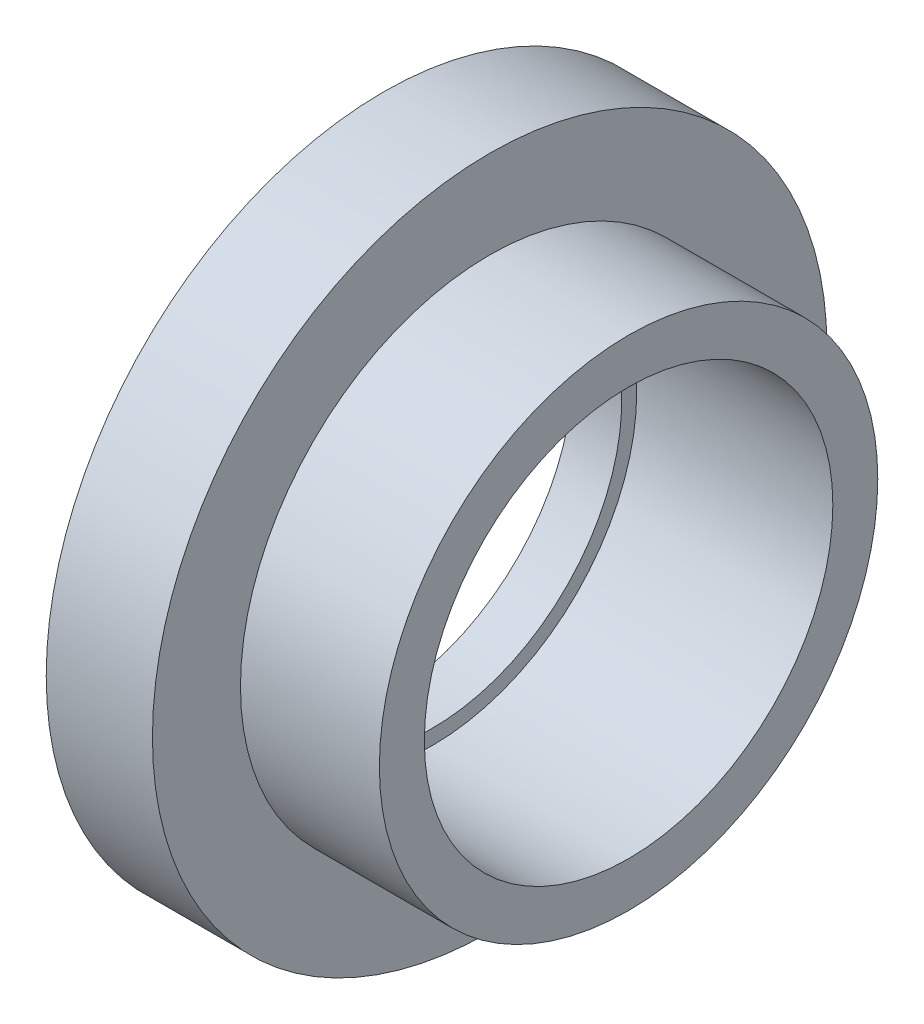
ISO-10303-21;
HEADER;
FILE_DESCRIPTION(('STEP AP214'),'2;1');
FILE_NAME('part.step','',(''),(''),'','','');
FILE_SCHEMA(('AUTOMOTIVE_DESIGN { 1 0 10303 214 1 1 1 1 }'));
ENDSEC;
DATA;
#1=APPLICATION_CONTEXT('core data for automotive mechanical design processes');
#2=APPLICATION_PROTOCOL_DEFINITION('international standard','automotive_design',2000,#1);
#3=PRODUCT_CONTEXT('',#1,'mechanical');
#4=PRODUCT('Part','Part','',(#3));
#5=PRODUCT_RELATED_PRODUCT_CATEGORY('part','',(#4));
#6=PRODUCT_DEFINITION_FORMATION('','',#4);
#7=PRODUCT_DEFINITION_CONTEXT('part definition',#1,'design');
#8=PRODUCT_DEFINITION('design','',#6,#7);
#9=PRODUCT_DEFINITION_SHAPE('','',#8);
#10=(LENGTH_UNIT() NAMED_UNIT(*) SI_UNIT(.MILLI.,.METRE.));
#11=(NAMED_UNIT(*) PLANE_ANGLE_UNIT() SI_UNIT($,.RADIAN.));
#12=(NAMED_UNIT(*) SI_UNIT($,.STERADIAN.) SOLID_ANGLE_UNIT());
#13=UNCERTAINTY_MEASURE_WITH_UNIT(LENGTH_MEASURE(1.E-05),#10,'distance_accuracy_value','');
#14=(GEOMETRIC_REPRESENTATION_CONTEXT(3) GLOBAL_UNCERTAINTY_ASSIGNED_CONTEXT((#13)) GLOBAL_UNIT_ASSIGNED_CONTEXT((#10,
#11,#12)) REPRESENTATION_CONTEXT('',''));
#15=CARTESIAN_POINT('',(0.,0.,0.));
#16=DIRECTION('',(0.,0.,1.));
#17=DIRECTION('',(1.,0.,0.));
#18=AXIS2_PLACEMENT_3D('',#15,#16,#17);
#19=CARTESIAN_POINT('',(7.,0.,0.));
#20=DIRECTION('',(-1.,0.,0.));
#21=DIRECTION('',(0.,0.,1.));
#22=AXIS2_PLACEMENT_3D('',#19,#20,#21);
#23=CYLINDRICAL_SURFACE('',#22,30.5);
#24=CARTESIAN_POINT('',(7.,0.,0.));
#25=DIRECTION('',(-1.,0.,0.));
#26=DIRECTION('',(0.,0.,1.));
#27=AXIS2_PLACEMENT_3D('',#24,#25,#26);
#28=CIRCLE('',#27,30.5);
#29=CARTESIAN_POINT('',(7.,0.,30.5));
#30=VERTEX_POINT('',#29);
#31=EDGE_CURVE('E38',#30,#30,#28,.T.);
#32=ORIENTED_EDGE('',*,*,#31,.F.);
#33=EDGE_LOOP('',(#32));
#34=FACE_BOUND('',#33,.T.);
#35=CARTESIAN_POINT('',(24.,0.,0.));
#36=DIRECTION('',(-1.,0.,0.));
#37=DIRECTION('',(0.,0.,1.));
#38=AXIS2_PLACEMENT_3D('',#35,#36,#37);
#39=CIRCLE('',#38,30.5);
#40=CARTESIAN_POINT('',(24.,0.,30.5));
#41=VERTEX_POINT('',#40);
#42=EDGE_CURVE('E16',#41,#41,#39,.F.);
#43=ORIENTED_EDGE('',*,*,#42,.F.);
#44=EDGE_LOOP('',(#43));
#45=FACE_BOUND('',#44,.T.);
#46=ADVANCED_FACE('F13',(#34,#45),#23,.T.);
#47=CARTESIAN_POINT('',(24.,30.5,30.8660010541286));
#48=DIRECTION('',(1.,0.,0.));
#49=DIRECTION('',(0.,-1.,0.));
#50=AXIS2_PLACEMENT_3D('',#47,#48,#49);
#51=PLANE('',#50);
#52=CARTESIAN_POINT('',(24.,0.,0.));
#53=DIRECTION('',(-1.,0.,0.));
#54=DIRECTION('',(0.,0.,1.));
#55=AXIS2_PLACEMENT_3D('',#52,#53,#54);
#56=CIRCLE('',#55,25.);
#57=CARTESIAN_POINT('',(24.,0.,25.));
#58=VERTEX_POINT('',#57);
#59=EDGE_CURVE('E36',#58,#58,#56,.F.);
#60=ORIENTED_EDGE('',*,*,#59,.F.);
#61=EDGE_LOOP('',(#60));
#62=FACE_BOUND('',#61,.T.);
#63=ORIENTED_EDGE('',*,*,#42,.T.);
#64=EDGE_LOOP('',(#63));
#65=FACE_BOUND('',#64,.T.);
#66=ADVANCED_FACE('F45',(#62,#65),#51,.T.);
#67=CARTESIAN_POINT('',(7.,41.275,41.7703021083259));
#68=DIRECTION('',(1.,0.,0.));
#69=DIRECTION('',(0.,-1.,0.));
#70=AXIS2_PLACEMENT_3D('',#67,#68,#69);
#71=PLANE('',#70);
#72=ORIENTED_EDGE('',*,*,#31,.T.);
#73=EDGE_LOOP('',(#72));
#74=FACE_BOUND('',#73,.T.);
#75=CARTESIAN_POINT('',(7.,0.,0.));
#76=DIRECTION('',(-1.,0.,0.));
#77=DIRECTION('',(0.,0.,1.));
#78=AXIS2_PLACEMENT_3D('',#75,#76,#77);
#79=CIRCLE('',#78,41.275);
#80=CARTESIAN_POINT('',(7.,0.,41.275));
#81=VERTEX_POINT('',#80);
#82=EDGE_CURVE('E33',#81,#81,#79,.T.);
#83=ORIENTED_EDGE('',*,*,#82,.F.);
#84=EDGE_LOOP('',(#83));
#85=FACE_BOUND('',#84,.T.);
#86=ADVANCED_FACE('F53',(#74,#85),#71,.T.);
#87=CARTESIAN_POINT('',(24.,0.,0.));
#88=DIRECTION('',(-1.,0.,0.));
#89=DIRECTION('',(0.,0.,1.));
#90=AXIS2_PLACEMENT_3D('',#87,#88,#89);
#91=CYLINDRICAL_SURFACE('',#90,25.);
#92=ORIENTED_EDGE('',*,*,#59,.T.);
#93=EDGE_LOOP('',(#92));
#94=FACE_BOUND('',#93,.T.);
#95=CARTESIAN_POINT('',(0.,0.,0.));
#96=DIRECTION('',(-1.,0.,0.));
#97=DIRECTION('',(0.,0.,1.));
#98=AXIS2_PLACEMENT_3D('',#95,#96,#97);
#99=CIRCLE('',#98,25.);
#100=CARTESIAN_POINT('',(0.,0.,25.));
#101=VERTEX_POINT('',#100);
#102=EDGE_CURVE('E30',#101,#101,#99,.F.);
#103=ORIENTED_EDGE('',*,*,#102,.F.);
#104=EDGE_LOOP('',(#103));
#105=FACE_BOUND('',#104,.T.);
#106=ADVANCED_FACE('F73',(#94,#105),#91,.F.);
#107=CARTESIAN_POINT('',(-6.,0.,0.));
#108=DIRECTION('',(-1.,0.,0.));
#109=DIRECTION('',(0.,0.,1.));
#110=AXIS2_PLACEMENT_3D('',#107,#108,#109);
#111=CYLINDRICAL_SURFACE('',#110,41.275);
#112=CARTESIAN_POINT('',(-6.,0.,0.));
#113=DIRECTION('',(-1.,0.,0.));
#114=DIRECTION('',(0.,0.,1.));
#115=AXIS2_PLACEMENT_3D('',#112,#113,#114);
#116=CIRCLE('',#115,41.275);
#117=CARTESIAN_POINT('',(-6.,0.,41.275));
#118=VERTEX_POINT('',#117);
#119=EDGE_CURVE('E25',#118,#118,#116,.T.);
#120=ORIENTED_EDGE('',*,*,#119,.F.);
#121=EDGE_LOOP('',(#120));
#122=FACE_BOUND('',#121,.T.);
#123=ORIENTED_EDGE('',*,*,#82,.T.);
#124=EDGE_LOOP('',(#123));
#125=FACE_BOUND('',#124,.T.);
#126=ADVANCED_FACE('F69',(#122,#125),#111,.T.);
#127=CARTESIAN_POINT('',(0.,25.,25.3000021083545));
#128=DIRECTION('',(1.,0.,0.));
#129=DIRECTION('',(0.,-1.,0.));
#130=AXIS2_PLACEMENT_3D('',#127,#128,#129);
#131=PLANE('',#130);
#132=CARTESIAN_POINT('',(0.,0.,0.));
#133=DIRECTION('',(-1.,0.,0.));
#134=DIRECTION('',(0.,0.,1.));
#135=AXIS2_PLACEMENT_3D('',#132,#133,#134);
#136=CIRCLE('',#135,23.1666666666667);
#137=CARTESIAN_POINT('',(0.,0.,23.1666666666667));
#138=VERTEX_POINT('',#137);
#139=EDGE_CURVE('E20',#138,#138,#136,.F.);
#140=ORIENTED_EDGE('',*,*,#139,.F.);
#141=EDGE_LOOP('',(#140));
#142=FACE_BOUND('',#141,.T.);
#143=ORIENTED_EDGE('',*,*,#102,.T.);
#144=EDGE_LOOP('',(#143));
#145=FACE_BOUND('',#144,.T.);
#146=ADVANCED_FACE('F63',(#142,#145),#131,.T.);
#147=CARTESIAN_POINT('',(-6.,-41.275,41.7703021083259));
#148=DIRECTION('',(-1.,0.,0.));
#149=DIRECTION('',(0.,1.,0.));
#150=AXIS2_PLACEMENT_3D('',#147,#148,#149);
#151=PLANE('',#150);
#152=CARTESIAN_POINT('',(-6.,0.,0.));
#153=DIRECTION('',(-1.,0.,0.));
#154=DIRECTION('',(0.,0.,1.));
#155=AXIS2_PLACEMENT_3D('',#152,#153,#154);
#156=CIRCLE('',#155,23.1666666666667);
#157=CARTESIAN_POINT('',(-6.,0.,23.1666666666667));
#158=VERTEX_POINT('',#157);
#159=EDGE_CURVE('E8',#158,#158,#156,.T.);
#160=ORIENTED_EDGE('',*,*,#159,.F.);
#161=EDGE_LOOP('',(#160));
#162=FACE_BOUND('',#161,.T.);
#163=ORIENTED_EDGE('',*,*,#119,.T.);
#164=EDGE_LOOP('',(#163));
#165=FACE_BOUND('',#164,.T.);
#166=ADVANCED_FACE('F57',(#162,#165),#151,.T.);
#167=CARTESIAN_POINT('',(0.,0.,0.));
#168=DIRECTION('',(-1.,0.,0.));
#169=DIRECTION('',(0.,0.,1.));
#170=AXIS2_PLACEMENT_3D('',#167,#168,#169);
#171=CYLINDRICAL_SURFACE('',#170,23.1666666666667);
#172=ORIENTED_EDGE('',*,*,#139,.T.);
#173=EDGE_LOOP('',(#172));
#174=FACE_BOUND('',#173,.T.);
#175=ORIENTED_EDGE('',*,*,#159,.T.);
#176=EDGE_LOOP('',(#175));
#177=FACE_BOUND('',#176,.T.);
#178=ADVANCED_FACE('F55',(#174,#177),#171,.F.);
#179=CLOSED_SHELL('',(#46,#66,#86,#106,#126,#146,#166,#178));
#180=MANIFOLD_SOLID_BREP('B1',#179);
#181=ADVANCED_BREP_SHAPE_REPRESENTATION('',(#18,#180),#14);
#182=SHAPE_DEFINITION_REPRESENTATION(#9,#181);
ENDSEC;
END-ISO-10303-21;
